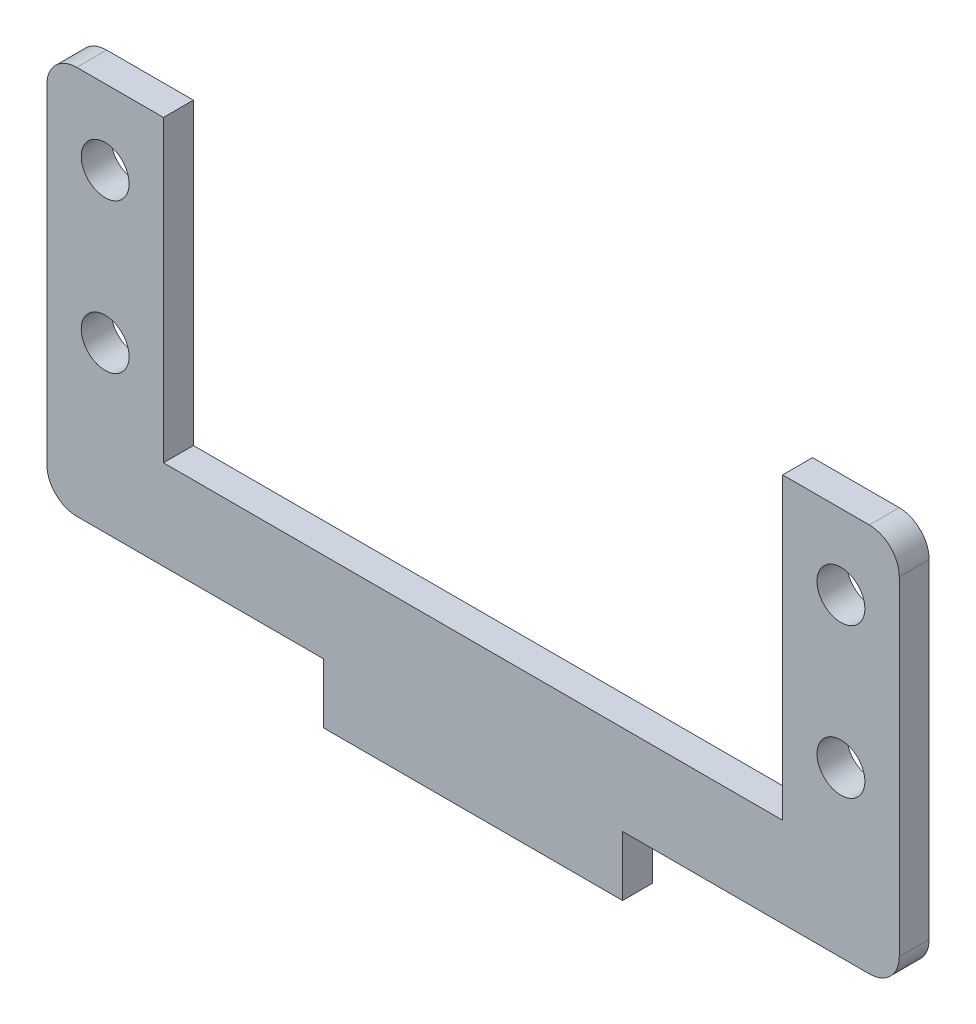
ISO-10303-21;
HEADER;
FILE_DESCRIPTION(('STEP AP214'),'2;1');
FILE_NAME('part.step','',(''),(''),'','','');
FILE_SCHEMA(('AUTOMOTIVE_DESIGN { 1 0 10303 214 1 1 1 1 }'));
ENDSEC;
DATA;
#1=APPLICATION_CONTEXT('core data for automotive mechanical design processes');
#2=APPLICATION_PROTOCOL_DEFINITION('international standard','automotive_design',2000,#1);
#3=PRODUCT_CONTEXT('',#1,'mechanical');
#4=PRODUCT('Part','Part','',(#3));
#5=PRODUCT_RELATED_PRODUCT_CATEGORY('part','',(#4));
#6=PRODUCT_DEFINITION_FORMATION('','',#4);
#7=PRODUCT_DEFINITION_CONTEXT('part definition',#1,'design');
#8=PRODUCT_DEFINITION('design','',#6,#7);
#9=PRODUCT_DEFINITION_SHAPE('','',#8);
#10=(LENGTH_UNIT() NAMED_UNIT(*) SI_UNIT(.MILLI.,.METRE.));
#11=(NAMED_UNIT(*) PLANE_ANGLE_UNIT() SI_UNIT($,.RADIAN.));
#12=(NAMED_UNIT(*) SI_UNIT($,.STERADIAN.) SOLID_ANGLE_UNIT());
#13=UNCERTAINTY_MEASURE_WITH_UNIT(LENGTH_MEASURE(1.E-05),#10,'distance_accuracy_value','');
#14=(GEOMETRIC_REPRESENTATION_CONTEXT(3) GLOBAL_UNCERTAINTY_ASSIGNED_CONTEXT((#13)) GLOBAL_UNIT_ASSIGNED_CONTEXT((#10,
#11,#12)) REPRESENTATION_CONTEXT('',''));
#15=CARTESIAN_POINT('',(0.,0.,0.));
#16=DIRECTION('',(0.,0.,1.));
#17=DIRECTION('',(1.,0.,0.));
#18=AXIS2_PLACEMENT_3D('',#15,#16,#17);
#19=CARTESIAN_POINT('',(0.,0.,2.));
#20=DIRECTION('',(0.,0.,1.));
#21=DIRECTION('',(1.,0.,0.));
#22=AXIS2_PLACEMENT_3D('',#19,#20,#21);
#23=PLANE('',#22);
#24=CARTESIAN_POINT('',(24.6,15.,2.));
#25=DIRECTION('',(0.,0.,1.));
#26=DIRECTION('',(1.,0.,0.));
#27=AXIS2_PLACEMENT_3D('',#24,#25,#26);
#28=CIRCLE('',#27,1.6);
#29=CARTESIAN_POINT('',(26.2,15.,2.));
#30=VERTEX_POINT('',#29);
#31=EDGE_CURVE('E296',#30,#30,#28,.T.);
#32=ORIENTED_EDGE('',*,*,#31,.F.);
#33=EDGE_LOOP('',(#32));
#34=FACE_BOUND('',#33,.T.);
#35=CARTESIAN_POINT('',(-24.6,25.,2.));
#36=DIRECTION('',(0.,0.,1.));
#37=DIRECTION('',(1.,0.,0.));
#38=AXIS2_PLACEMENT_3D('',#35,#36,#37);
#39=CIRCLE('',#38,1.6);
#40=CARTESIAN_POINT('',(-23.,25.,2.));
#41=VERTEX_POINT('',#40);
#42=EDGE_CURVE('E271',#41,#41,#39,.T.);
#43=ORIENTED_EDGE('',*,*,#42,.F.);
#44=EDGE_LOOP('',(#43));
#45=FACE_BOUND('',#44,.T.);
#46=DIRECTION('',(-1.,0.,0.));
#47=VECTOR('',#46,1.);
#48=CARTESIAN_POINT('',(-28.5,30.,2.));
#49=LINE('',#48,#47);
#50=CARTESIAN_POINT('',(-20.7,30.,2.));
#51=VERTEX_POINT('',#50);
#52=CARTESIAN_POINT('',(-26.5,30.,2.));
#53=VERTEX_POINT('',#52);
#54=EDGE_CURVE('E275',#51,#53,#49,.T.);
#55=ORIENTED_EDGE('',*,*,#54,.T.);
#56=CARTESIAN_POINT('',(-26.5,28.,2.));
#57=DIRECTION('',(0.,0.,1.));
#58=DIRECTION('',(1.,0.,0.));
#59=AXIS2_PLACEMENT_3D('',#56,#57,#58);
#60=CIRCLE('',#59,2.);
#61=CARTESIAN_POINT('',(-28.5,28.,2.));
#62=VERTEX_POINT('',#61);
#63=EDGE_CURVE('E194',#53,#62,#60,.T.);
#64=ORIENTED_EDGE('',*,*,#63,.T.);
#65=DIRECTION('',(0.,-1.,0.));
#66=VECTOR('',#65,1.);
#67=CARTESIAN_POINT('',(-28.5,3.99999999999999,2.));
#68=LINE('',#67,#66);
#69=CARTESIAN_POINT('',(-28.5,5.99999999999999,2.));
#70=VERTEX_POINT('',#69);
#71=EDGE_CURVE('E273',#62,#70,#68,.T.);
#72=ORIENTED_EDGE('',*,*,#71,.T.);
#73=CARTESIAN_POINT('',(-26.5,5.99999999999999,2.));
#74=DIRECTION('',(0.,0.,1.));
#75=DIRECTION('',(1.,0.,0.));
#76=AXIS2_PLACEMENT_3D('',#73,#74,#75);
#77=CIRCLE('',#76,2.);
#78=CARTESIAN_POINT('',(-26.5,3.99999999999999,2.));
#79=VERTEX_POINT('',#78);
#80=EDGE_CURVE('E47',#70,#79,#77,.T.);
#81=ORIENTED_EDGE('',*,*,#80,.T.);
#82=DIRECTION('',(1.,0.,0.));
#83=VECTOR('',#82,1.);
#84=CARTESIAN_POINT('',(-10.,4.,2.));
#85=LINE('',#84,#83);
#86=CARTESIAN_POINT('',(-10.,4.,2.));
#87=VERTEX_POINT('',#86);
#88=EDGE_CURVE('E161',#79,#87,#85,.T.);
#89=ORIENTED_EDGE('',*,*,#88,.T.);
#90=DIRECTION('',(0.,-1.,0.));
#91=VECTOR('',#90,1.);
#92=CARTESIAN_POINT('',(-10.,0.,2.));
#93=LINE('',#92,#91);
#94=CARTESIAN_POINT('',(-10.,0.,2.));
#95=VERTEX_POINT('',#94);
#96=EDGE_CURVE('E156',#87,#95,#93,.T.);
#97=ORIENTED_EDGE('',*,*,#96,.T.);
#98=DIRECTION('',(1.,0.,0.));
#99=VECTOR('',#98,1.);
#100=CARTESIAN_POINT('',(-10.,0.,2.));
#101=LINE('',#100,#99);
#102=CARTESIAN_POINT('',(10.,0.,2.));
#103=VERTEX_POINT('',#102);
#104=EDGE_CURVE('E146',#95,#103,#101,.T.);
#105=ORIENTED_EDGE('',*,*,#104,.T.);
#106=DIRECTION('',(0.,1.,0.));
#107=VECTOR('',#106,1.);
#108=CARTESIAN_POINT('',(10.,0.,2.));
#109=LINE('',#108,#107);
#110=CARTESIAN_POINT('',(10.,4.,2.));
#111=VERTEX_POINT('',#110);
#112=EDGE_CURVE('E155',#103,#111,#109,.T.);
#113=ORIENTED_EDGE('',*,*,#112,.T.);
#114=DIRECTION('',(1.,0.,0.));
#115=VECTOR('',#114,1.);
#116=CARTESIAN_POINT('',(10.,4.,2.));
#117=LINE('',#116,#115);
#118=CARTESIAN_POINT('',(26.5,3.99999999999999,2.));
#119=VERTEX_POINT('',#118);
#120=EDGE_CURVE('E210',#111,#119,#117,.T.);
#121=ORIENTED_EDGE('',*,*,#120,.T.);
#122=CARTESIAN_POINT('',(26.5,5.99999999999999,2.));
#123=DIRECTION('',(0.,0.,1.));
#124=DIRECTION('',(1.,0.,0.));
#125=AXIS2_PLACEMENT_3D('',#122,#123,#124);
#126=CIRCLE('',#125,2.);
#127=CARTESIAN_POINT('',(28.5,5.99999999999999,2.));
#128=VERTEX_POINT('',#127);
#129=EDGE_CURVE('E191',#119,#128,#126,.T.);
#130=ORIENTED_EDGE('',*,*,#129,.T.);
#131=DIRECTION('',(0.,1.,0.));
#132=VECTOR('',#131,1.);
#133=CARTESIAN_POINT('',(28.5,3.99999999999999,2.));
#134=LINE('',#133,#132);
#135=CARTESIAN_POINT('',(28.5,28.,2.));
#136=VERTEX_POINT('',#135);
#137=EDGE_CURVE('E217',#128,#136,#134,.T.);
#138=ORIENTED_EDGE('',*,*,#137,.T.);
#139=CARTESIAN_POINT('',(26.5,28.,2.));
#140=DIRECTION('',(0.,0.,1.));
#141=DIRECTION('',(1.,0.,0.));
#142=AXIS2_PLACEMENT_3D('',#139,#140,#141);
#143=CIRCLE('',#142,2.);
#144=CARTESIAN_POINT('',(26.5,30.,2.));
#145=VERTEX_POINT('',#144);
#146=EDGE_CURVE('E54',#136,#145,#143,.T.);
#147=ORIENTED_EDGE('',*,*,#146,.T.);
#148=DIRECTION('',(-1.,0.,0.));
#149=VECTOR('',#148,1.);
#150=CARTESIAN_POINT('',(28.5,30.,2.));
#151=LINE('',#150,#149);
#152=CARTESIAN_POINT('',(20.7,30.,2.));
#153=VERTEX_POINT('',#152);
#154=EDGE_CURVE('E283',#145,#153,#151,.T.);
#155=ORIENTED_EDGE('',*,*,#154,.T.);
#156=DIRECTION('',(0.,-1.,0.));
#157=VECTOR('',#156,1.);
#158=CARTESIAN_POINT('',(20.7,30.,2.));
#159=LINE('',#158,#157);
#160=CARTESIAN_POINT('',(20.7,10.,2.));
#161=VERTEX_POINT('',#160);
#162=EDGE_CURVE('E281',#153,#161,#159,.T.);
#163=ORIENTED_EDGE('',*,*,#162,.T.);
#164=DIRECTION('',(-1.,0.,0.));
#165=VECTOR('',#164,1.);
#166=CARTESIAN_POINT('',(-20.7,10.,2.));
#167=LINE('',#166,#165);
#168=CARTESIAN_POINT('',(-20.7,10.,2.));
#169=VERTEX_POINT('',#168);
#170=EDGE_CURVE('E279',#161,#169,#167,.T.);
#171=ORIENTED_EDGE('',*,*,#170,.T.);
#172=DIRECTION('',(0.,1.,0.));
#173=VECTOR('',#172,1.);
#174=CARTESIAN_POINT('',(-20.7,30.,2.));
#175=LINE('',#174,#173);
#176=EDGE_CURVE('E277',#169,#51,#175,.T.);
#177=ORIENTED_EDGE('',*,*,#176,.T.);
#178=EDGE_LOOP('',(#55,#64,#72,#81,#89,#97,#105,#113,#121,#130,#138,#147,#155,#163,#171,#177));
#179=FACE_BOUND('',#178,.T.);
#180=CARTESIAN_POINT('',(-24.6,15.,2.));
#181=DIRECTION('',(0.,0.,1.));
#182=DIRECTION('',(-1.,0.,0.));
#183=AXIS2_PLACEMENT_3D('',#180,#181,#182);
#184=CIRCLE('',#183,1.6);
#185=CARTESIAN_POINT('',(-26.2,15.,2.));
#186=VERTEX_POINT('',#185);
#187=EDGE_CURVE('E290',#186,#186,#184,.T.);
#188=ORIENTED_EDGE('',*,*,#187,.F.);
#189=EDGE_LOOP('',(#188));
#190=FACE_BOUND('',#189,.T.);
#191=CARTESIAN_POINT('',(24.6,25.,2.));
#192=DIRECTION('',(0.,0.,1.));
#193=DIRECTION('',(-1.,0.,0.));
#194=AXIS2_PLACEMENT_3D('',#191,#192,#193);
#195=CIRCLE('',#194,1.6);
#196=CARTESIAN_POINT('',(23.,25.,2.));
#197=VERTEX_POINT('',#196);
#198=EDGE_CURVE('E302',#197,#197,#195,.T.);
#199=ORIENTED_EDGE('',*,*,#198,.F.);
#200=EDGE_LOOP('',(#199));
#201=FACE_BOUND('',#200,.T.);
#202=ADVANCED_FACE('F32',(#34,#45,#179,#190,#201),#23,.T.);
#203=CARTESIAN_POINT('',(0.,0.,0.));
#204=DIRECTION('',(0.,0.,1.));
#205=DIRECTION('',(1.,0.,0.));
#206=AXIS2_PLACEMENT_3D('',#203,#204,#205);
#207=PLANE('',#206);
#208=CARTESIAN_POINT('',(24.6,15.,0.));
#209=DIRECTION('',(0.,0.,1.));
#210=DIRECTION('',(1.,0.,0.));
#211=AXIS2_PLACEMENT_3D('',#208,#209,#210);
#212=CIRCLE('',#211,1.6);
#213=CARTESIAN_POINT('',(26.2,15.,0.));
#214=VERTEX_POINT('',#213);
#215=EDGE_CURVE('E299',#214,#214,#212,.T.);
#216=ORIENTED_EDGE('',*,*,#215,.T.);
#217=EDGE_LOOP('',(#216));
#218=FACE_BOUND('',#217,.T.);
#219=CARTESIAN_POINT('',(-24.6,25.,0.));
#220=DIRECTION('',(0.,0.,1.));
#221=DIRECTION('',(1.,0.,0.));
#222=AXIS2_PLACEMENT_3D('',#219,#220,#221);
#223=CIRCLE('',#222,1.6);
#224=CARTESIAN_POINT('',(-23.,25.,0.));
#225=VERTEX_POINT('',#224);
#226=EDGE_CURVE('E287',#225,#225,#223,.T.);
#227=ORIENTED_EDGE('',*,*,#226,.T.);
#228=EDGE_LOOP('',(#227));
#229=FACE_BOUND('',#228,.T.);
#230=DIRECTION('',(0.,-1.,0.));
#231=VECTOR('',#230,1.);
#232=CARTESIAN_POINT('',(-28.5,3.99999999999999,0.));
#233=LINE('',#232,#231);
#234=CARTESIAN_POINT('',(-28.5,28.,0.));
#235=VERTEX_POINT('',#234);
#236=CARTESIAN_POINT('',(-28.5,5.99999999999999,0.));
#237=VERTEX_POINT('',#236);
#238=EDGE_CURVE('E248',#235,#237,#233,.T.);
#239=ORIENTED_EDGE('',*,*,#238,.F.);
#240=CARTESIAN_POINT('',(-26.5,28.,0.));
#241=DIRECTION('',(0.,0.,1.));
#242=DIRECTION('',(1.,0.,0.));
#243=AXIS2_PLACEMENT_3D('',#240,#241,#242);
#244=CIRCLE('',#243,2.);
#245=CARTESIAN_POINT('',(-26.5,30.,0.));
#246=VERTEX_POINT('',#245);
#247=EDGE_CURVE('E186',#235,#246,#244,.F.);
#248=ORIENTED_EDGE('',*,*,#247,.T.);
#249=DIRECTION('',(-1.,0.,0.));
#250=VECTOR('',#249,1.);
#251=CARTESIAN_POINT('',(-28.5,30.,0.));
#252=LINE('',#251,#250);
#253=CARTESIAN_POINT('',(-20.7,30.,0.));
#254=VERTEX_POINT('',#253);
#255=EDGE_CURVE('E245',#254,#246,#252,.T.);
#256=ORIENTED_EDGE('',*,*,#255,.F.);
#257=DIRECTION('',(0.,1.,0.));
#258=VECTOR('',#257,1.);
#259=CARTESIAN_POINT('',(-20.7,30.,0.));
#260=LINE('',#259,#258);
#261=CARTESIAN_POINT('',(-20.7,10.,0.));
#262=VERTEX_POINT('',#261);
#263=EDGE_CURVE('E243',#262,#254,#260,.T.);
#264=ORIENTED_EDGE('',*,*,#263,.F.);
#265=DIRECTION('',(-1.,0.,0.));
#266=VECTOR('',#265,1.);
#267=CARTESIAN_POINT('',(-20.7,10.,0.));
#268=LINE('',#267,#266);
#269=CARTESIAN_POINT('',(20.7,10.,0.));
#270=VERTEX_POINT('',#269);
#271=EDGE_CURVE('E241',#270,#262,#268,.T.);
#272=ORIENTED_EDGE('',*,*,#271,.F.);
#273=DIRECTION('',(0.,-1.,0.));
#274=VECTOR('',#273,1.);
#275=CARTESIAN_POINT('',(20.7,30.,0.));
#276=LINE('',#275,#274);
#277=CARTESIAN_POINT('',(20.7,30.,0.));
#278=VERTEX_POINT('',#277);
#279=EDGE_CURVE('E234',#278,#270,#276,.T.);
#280=ORIENTED_EDGE('',*,*,#279,.F.);
#281=DIRECTION('',(-1.,0.,0.));
#282=VECTOR('',#281,1.);
#283=CARTESIAN_POINT('',(28.5,30.,0.));
#284=LINE('',#283,#282);
#285=CARTESIAN_POINT('',(26.5,30.,0.));
#286=VERTEX_POINT('',#285);
#287=EDGE_CURVE('E232',#286,#278,#284,.T.);
#288=ORIENTED_EDGE('',*,*,#287,.F.);
#289=CARTESIAN_POINT('',(26.5,28.,0.));
#290=DIRECTION('',(0.,0.,1.));
#291=DIRECTION('',(1.,0.,0.));
#292=AXIS2_PLACEMENT_3D('',#289,#290,#291);
#293=CIRCLE('',#292,2.);
#294=CARTESIAN_POINT('',(28.5,28.,0.));
#295=VERTEX_POINT('',#294);
#296=EDGE_CURVE('E184',#286,#295,#293,.F.);
#297=ORIENTED_EDGE('',*,*,#296,.T.);
#298=DIRECTION('',(0.,1.,0.));
#299=VECTOR('',#298,1.);
#300=CARTESIAN_POINT('',(28.5,3.99999999999999,0.));
#301=LINE('',#300,#299);
#302=CARTESIAN_POINT('',(28.5,5.99999999999999,0.));
#303=VERTEX_POINT('',#302);
#304=EDGE_CURVE('E225',#303,#295,#301,.T.);
#305=ORIENTED_EDGE('',*,*,#304,.F.);
#306=CARTESIAN_POINT('',(26.5,5.99999999999999,0.));
#307=DIRECTION('',(0.,0.,1.));
#308=DIRECTION('',(1.,0.,0.));
#309=AXIS2_PLACEMENT_3D('',#306,#307,#308);
#310=CIRCLE('',#309,2.);
#311=CARTESIAN_POINT('',(26.5,3.99999999999999,0.));
#312=VERTEX_POINT('',#311);
#313=EDGE_CURVE('E182',#303,#312,#310,.F.);
#314=ORIENTED_EDGE('',*,*,#313,.T.);
#315=DIRECTION('',(1.,0.,0.));
#316=VECTOR('',#315,1.);
#317=CARTESIAN_POINT('',(10.,4.,0.));
#318=LINE('',#317,#316);
#319=CARTESIAN_POINT('',(10.,4.,0.));
#320=VERTEX_POINT('',#319);
#321=EDGE_CURVE('E212',#320,#312,#318,.T.);
#322=ORIENTED_EDGE('',*,*,#321,.F.);
#323=DIRECTION('',(0.,1.,0.));
#324=VECTOR('',#323,1.);
#325=CARTESIAN_POINT('',(10.,0.,0.));
#326=LINE('',#325,#324);
#327=CARTESIAN_POINT('',(10.,0.,0.));
#328=VERTEX_POINT('',#327);
#329=EDGE_CURVE('E236',#328,#320,#326,.T.);
#330=ORIENTED_EDGE('',*,*,#329,.F.);
#331=DIRECTION('',(1.,0.,0.));
#332=VECTOR('',#331,1.);
#333=CARTESIAN_POINT('',(-10.,0.,0.));
#334=LINE('',#333,#332);
#335=CARTESIAN_POINT('',(-10.,0.,0.));
#336=VERTEX_POINT('',#335);
#337=EDGE_CURVE('E267',#336,#328,#334,.T.);
#338=ORIENTED_EDGE('',*,*,#337,.F.);
#339=DIRECTION('',(0.,-1.,0.));
#340=VECTOR('',#339,1.);
#341=CARTESIAN_POINT('',(-10.,0.,0.));
#342=LINE('',#341,#340);
#343=CARTESIAN_POINT('',(-10.,4.,0.));
#344=VERTEX_POINT('',#343);
#345=EDGE_CURVE('E169',#344,#336,#342,.T.);
#346=ORIENTED_EDGE('',*,*,#345,.F.);
#347=DIRECTION('',(1.,0.,0.));
#348=VECTOR('',#347,1.);
#349=CARTESIAN_POINT('',(-10.,4.,0.));
#350=LINE('',#349,#348);
#351=CARTESIAN_POINT('',(-26.5,3.99999999999999,0.));
#352=VERTEX_POINT('',#351);
#353=EDGE_CURVE('E165',#352,#344,#350,.T.);
#354=ORIENTED_EDGE('',*,*,#353,.F.);
#355=CARTESIAN_POINT('',(-26.5,5.99999999999999,0.));
#356=DIRECTION('',(0.,0.,1.));
#357=DIRECTION('',(1.,0.,0.));
#358=AXIS2_PLACEMENT_3D('',#355,#356,#357);
#359=CIRCLE('',#358,2.);
#360=EDGE_CURVE('E180',#352,#237,#359,.F.);
#361=ORIENTED_EDGE('',*,*,#360,.T.);
#362=EDGE_LOOP('',(#239,#248,#256,#264,#272,#280,#288,#297,#305,#314,#322,#330,#338,#346,#354,#361));
#363=FACE_BOUND('',#362,.T.);
#364=CARTESIAN_POINT('',(-24.6,15.,0.));
#365=DIRECTION('',(0.,0.,1.));
#366=DIRECTION('',(-1.,0.,0.));
#367=AXIS2_PLACEMENT_3D('',#364,#365,#366);
#368=CIRCLE('',#367,1.6);
#369=CARTESIAN_POINT('',(-26.2,15.,0.));
#370=VERTEX_POINT('',#369);
#371=EDGE_CURVE('E293',#370,#370,#368,.T.);
#372=ORIENTED_EDGE('',*,*,#371,.T.);
#373=EDGE_LOOP('',(#372));
#374=FACE_BOUND('',#373,.T.);
#375=CARTESIAN_POINT('',(24.6,25.,0.));
#376=DIRECTION('',(0.,0.,1.));
#377=DIRECTION('',(-1.,0.,0.));
#378=AXIS2_PLACEMENT_3D('',#375,#376,#377);
#379=CIRCLE('',#378,1.6);
#380=CARTESIAN_POINT('',(23.,25.,0.));
#381=VERTEX_POINT('',#380);
#382=EDGE_CURVE('E305',#381,#381,#379,.T.);
#383=ORIENTED_EDGE('',*,*,#382,.T.);
#384=EDGE_LOOP('',(#383));
#385=FACE_BOUND('',#384,.T.);
#386=ADVANCED_FACE('F229',(#218,#229,#363,#374,#385),#207,.F.);
#387=CARTESIAN_POINT('',(-10.,0.,2.));
#388=DIRECTION('',(1.,0.,0.));
#389=DIRECTION('',(0.,0.,-1.));
#390=AXIS2_PLACEMENT_3D('',#387,#388,#389);
#391=PLANE('',#390);
#392=ORIENTED_EDGE('',*,*,#345,.T.);
#393=DIRECTION('',(0.,0.,-1.));
#394=VECTOR('',#393,1.);
#395=CARTESIAN_POINT('',(-10.,0.,2.));
#396=LINE('',#395,#394);
#397=EDGE_CURVE('E150',#95,#336,#396,.T.);
#398=ORIENTED_EDGE('',*,*,#397,.F.);
#399=ORIENTED_EDGE('',*,*,#96,.F.);
#400=DIRECTION('',(0.,0.,-1.));
#401=VECTOR('',#400,1.);
#402=CARTESIAN_POINT('',(-10.,4.,2.));
#403=LINE('',#402,#401);
#404=EDGE_CURVE('E252',#87,#344,#403,.T.);
#405=ORIENTED_EDGE('',*,*,#404,.T.);
#406=EDGE_LOOP('',(#392,#398,#399,#405));
#407=FACE_BOUND('',#406,.T.);
#408=ADVANCED_FACE('F167',(#407),#391,.F.);
#409=CARTESIAN_POINT('',(-10.,0.,2.));
#410=DIRECTION('',(0.,1.,0.));
#411=DIRECTION('',(0.,0.,1.));
#412=AXIS2_PLACEMENT_3D('',#409,#410,#411);
#413=PLANE('',#412);
#414=ORIENTED_EDGE('',*,*,#337,.T.);
#415=DIRECTION('',(0.,0.,-1.));
#416=VECTOR('',#415,1.);
#417=CARTESIAN_POINT('',(10.,0.,2.));
#418=LINE('',#417,#416);
#419=EDGE_CURVE('E153',#103,#328,#418,.T.);
#420=ORIENTED_EDGE('',*,*,#419,.F.);
#421=ORIENTED_EDGE('',*,*,#104,.F.);
#422=ORIENTED_EDGE('',*,*,#397,.T.);
#423=EDGE_LOOP('',(#414,#420,#421,#422));
#424=FACE_BOUND('',#423,.T.);
#425=ADVANCED_FACE('F148',(#424),#413,.F.);
#426=CARTESIAN_POINT('',(10.,0.,2.));
#427=DIRECTION('',(-1.,0.,0.));
#428=DIRECTION('',(0.,0.,1.));
#429=AXIS2_PLACEMENT_3D('',#426,#427,#428);
#430=PLANE('',#429);
#431=ORIENTED_EDGE('',*,*,#329,.T.);
#432=DIRECTION('',(0.,0.,-1.));
#433=VECTOR('',#432,1.);
#434=CARTESIAN_POINT('',(10.,4.,2.));
#435=LINE('',#434,#433);
#436=EDGE_CURVE('E174',#111,#320,#435,.T.);
#437=ORIENTED_EDGE('',*,*,#436,.F.);
#438=ORIENTED_EDGE('',*,*,#112,.F.);
#439=ORIENTED_EDGE('',*,*,#419,.T.);
#440=EDGE_LOOP('',(#431,#437,#438,#439));
#441=FACE_BOUND('',#440,.T.);
#442=ADVANCED_FACE('F360',(#441),#430,.F.);
#443=CARTESIAN_POINT('',(10.,4.,2.));
#444=DIRECTION('',(0.,1.,0.));
#445=DIRECTION('',(-1.,0.,0.));
#446=AXIS2_PLACEMENT_3D('',#443,#444,#445);
#447=PLANE('',#446);
#448=ORIENTED_EDGE('',*,*,#321,.T.);
#449=DIRECTION('',(0.,0.,-1.));
#450=VECTOR('',#449,1.);
#451=CARTESIAN_POINT('',(26.5,3.99999999999999,2.));
#452=LINE('',#451,#450);
#453=EDGE_CURVE('E40',#312,#119,#452,.F.);
#454=ORIENTED_EDGE('',*,*,#453,.T.);
#455=ORIENTED_EDGE('',*,*,#120,.F.);
#456=ORIENTED_EDGE('',*,*,#436,.T.);
#457=EDGE_LOOP('',(#448,#454,#455,#456));
#458=FACE_BOUND('',#457,.T.);
#459=ADVANCED_FACE('F208',(#458),#447,.F.);
#460=CARTESIAN_POINT('',(28.5,3.99999999999999,2.));
#461=DIRECTION('',(-1.,0.,0.));
#462=DIRECTION('',(0.,0.,1.));
#463=AXIS2_PLACEMENT_3D('',#460,#461,#462);
#464=PLANE('',#463);
#465=ORIENTED_EDGE('',*,*,#304,.T.);
#466=DIRECTION('',(0.,0.,-1.));
#467=VECTOR('',#466,1.);
#468=CARTESIAN_POINT('',(28.5,28.,2.));
#469=LINE('',#468,#467);
#470=EDGE_CURVE('E202',#295,#136,#469,.F.);
#471=ORIENTED_EDGE('',*,*,#470,.T.);
#472=ORIENTED_EDGE('',*,*,#137,.F.);
#473=DIRECTION('',(0.,0.,-1.));
#474=VECTOR('',#473,1.);
#475=CARTESIAN_POINT('',(28.5,5.99999999999999,2.));
#476=LINE('',#475,#474);
#477=EDGE_CURVE('E199',#128,#303,#476,.T.);
#478=ORIENTED_EDGE('',*,*,#477,.T.);
#479=EDGE_LOOP('',(#465,#471,#472,#478));
#480=FACE_BOUND('',#479,.T.);
#481=ADVANCED_FACE('F224',(#480),#464,.F.);
#482=CARTESIAN_POINT('',(28.5,30.,2.));
#483=DIRECTION('',(0.,-1.,0.));
#484=DIRECTION('',(1.,0.,0.));
#485=AXIS2_PLACEMENT_3D('',#482,#483,#484);
#486=PLANE('',#485);
#487=ORIENTED_EDGE('',*,*,#154,.F.);
#488=DIRECTION('',(0.,0.,-1.));
#489=VECTOR('',#488,1.);
#490=CARTESIAN_POINT('',(26.5,30.,2.));
#491=LINE('',#490,#489);
#492=EDGE_CURVE('E196',#145,#286,#491,.T.);
#493=ORIENTED_EDGE('',*,*,#492,.T.);
#494=ORIENTED_EDGE('',*,*,#287,.T.);
#495=DIRECTION('',(0.,0.,-1.));
#496=VECTOR('',#495,1.);
#497=CARTESIAN_POINT('',(20.7,30.,2.));
#498=LINE('',#497,#496);
#499=EDGE_CURVE('E263',#153,#278,#498,.T.);
#500=ORIENTED_EDGE('',*,*,#499,.F.);
#501=EDGE_LOOP('',(#487,#493,#494,#500));
#502=FACE_BOUND('',#501,.T.);
#503=ADVANCED_FACE('F351',(#502),#486,.F.);
#504=CARTESIAN_POINT('',(20.7,30.,2.));
#505=DIRECTION('',(1.,0.,0.));
#506=DIRECTION('',(0.,1.,0.));
#507=AXIS2_PLACEMENT_3D('',#504,#505,#506);
#508=PLANE('',#507);
#509=ORIENTED_EDGE('',*,*,#279,.T.);
#510=DIRECTION('',(0.,0.,-1.));
#511=VECTOR('',#510,1.);
#512=CARTESIAN_POINT('',(20.7,10.,2.));
#513=LINE('',#512,#511);
#514=EDGE_CURVE('E260',#161,#270,#513,.T.);
#515=ORIENTED_EDGE('',*,*,#514,.F.);
#516=ORIENTED_EDGE('',*,*,#162,.F.);
#517=ORIENTED_EDGE('',*,*,#499,.T.);
#518=EDGE_LOOP('',(#509,#515,#516,#517));
#519=FACE_BOUND('',#518,.T.);
#520=ADVANCED_FACE('F347',(#519),#508,.F.);
#521=CARTESIAN_POINT('',(-20.7,10.,2.));
#522=DIRECTION('',(0.,-1.,0.));
#523=DIRECTION('',(0.,0.,-1.));
#524=AXIS2_PLACEMENT_3D('',#521,#522,#523);
#525=PLANE('',#524);
#526=ORIENTED_EDGE('',*,*,#271,.T.);
#527=DIRECTION('',(0.,0.,-1.));
#528=VECTOR('',#527,1.);
#529=CARTESIAN_POINT('',(-20.7,10.,2.));
#530=LINE('',#529,#528);
#531=EDGE_CURVE('E257',#169,#262,#530,.T.);
#532=ORIENTED_EDGE('',*,*,#531,.F.);
#533=ORIENTED_EDGE('',*,*,#170,.F.);
#534=ORIENTED_EDGE('',*,*,#514,.T.);
#535=EDGE_LOOP('',(#526,#532,#533,#534));
#536=FACE_BOUND('',#535,.T.);
#537=ADVANCED_FACE('F343',(#536),#525,.F.);
#538=CARTESIAN_POINT('',(-20.7,30.,2.));
#539=DIRECTION('',(-1.,0.,0.));
#540=DIRECTION('',(0.,0.,1.));
#541=AXIS2_PLACEMENT_3D('',#538,#539,#540);
#542=PLANE('',#541);
#543=ORIENTED_EDGE('',*,*,#263,.T.);
#544=DIRECTION('',(0.,0.,-1.));
#545=VECTOR('',#544,1.);
#546=CARTESIAN_POINT('',(-20.7,30.,2.));
#547=LINE('',#546,#545);
#548=EDGE_CURVE('E254',#51,#254,#547,.T.);
#549=ORIENTED_EDGE('',*,*,#548,.F.);
#550=ORIENTED_EDGE('',*,*,#176,.F.);
#551=ORIENTED_EDGE('',*,*,#531,.T.);
#552=EDGE_LOOP('',(#543,#549,#550,#551));
#553=FACE_BOUND('',#552,.T.);
#554=ADVANCED_FACE('F339',(#553),#542,.F.);
#555=CARTESIAN_POINT('',(-28.5,30.,2.));
#556=DIRECTION('',(0.,-1.,0.));
#557=DIRECTION('',(0.,0.,-1.));
#558=AXIS2_PLACEMENT_3D('',#555,#556,#557);
#559=PLANE('',#558);
#560=ORIENTED_EDGE('',*,*,#255,.T.);
#561=DIRECTION('',(0.,0.,-1.));
#562=VECTOR('',#561,1.);
#563=CARTESIAN_POINT('',(-26.5,30.,2.));
#564=LINE('',#563,#562);
#565=EDGE_CURVE('E188',#246,#53,#564,.F.);
#566=ORIENTED_EDGE('',*,*,#565,.T.);
#567=ORIENTED_EDGE('',*,*,#54,.F.);
#568=ORIENTED_EDGE('',*,*,#548,.T.);
#569=EDGE_LOOP('',(#560,#566,#567,#568));
#570=FACE_BOUND('',#569,.T.);
#571=ADVANCED_FACE('F335',(#570),#559,.F.);
#572=CARTESIAN_POINT('',(-28.5,3.99999999999999,2.));
#573=DIRECTION('',(1.,0.,0.));
#574=DIRECTION('',(0.,0.,-1.));
#575=AXIS2_PLACEMENT_3D('',#572,#573,#574);
#576=PLANE('',#575);
#577=ORIENTED_EDGE('',*,*,#71,.F.);
#578=DIRECTION('',(0.,0.,-1.));
#579=VECTOR('',#578,1.);
#580=CARTESIAN_POINT('',(-28.5,28.,2.));
#581=LINE('',#580,#579);
#582=EDGE_CURVE('E172',#62,#235,#581,.T.);
#583=ORIENTED_EDGE('',*,*,#582,.T.);
#584=ORIENTED_EDGE('',*,*,#238,.T.);
#585=DIRECTION('',(0.,0.,-1.));
#586=VECTOR('',#585,1.);
#587=CARTESIAN_POINT('',(-28.5,5.99999999999999,2.));
#588=LINE('',#587,#586);
#589=EDGE_CURVE('E170',#237,#70,#588,.F.);
#590=ORIENTED_EDGE('',*,*,#589,.T.);
#591=EDGE_LOOP('',(#577,#583,#584,#590));
#592=FACE_BOUND('',#591,.T.);
#593=ADVANCED_FACE('F331',(#592),#576,.F.);
#594=CARTESIAN_POINT('',(-10.,4.,2.));
#595=DIRECTION('',(0.,1.,0.));
#596=DIRECTION('',(-1.,0.,0.));
#597=AXIS2_PLACEMENT_3D('',#594,#595,#596);
#598=PLANE('',#597);
#599=ORIENTED_EDGE('',*,*,#88,.F.);
#600=DIRECTION('',(0.,0.,-1.));
#601=VECTOR('',#600,1.);
#602=CARTESIAN_POINT('',(-26.5,3.99999999999999,2.));
#603=LINE('',#602,#601);
#604=EDGE_CURVE('E11',#79,#352,#603,.T.);
#605=ORIENTED_EDGE('',*,*,#604,.T.);
#606=ORIENTED_EDGE('',*,*,#353,.T.);
#607=ORIENTED_EDGE('',*,*,#404,.F.);
#608=EDGE_LOOP('',(#599,#605,#606,#607));
#609=FACE_BOUND('',#608,.T.);
#610=ADVANCED_FACE('F328',(#609),#598,.F.);
#611=CARTESIAN_POINT('',(-24.6,25.,2.));
#612=DIRECTION('',(0.,0.,-1.));
#613=DIRECTION('',(-1.,0.,0.));
#614=AXIS2_PLACEMENT_3D('',#611,#612,#613);
#615=CYLINDRICAL_SURFACE('',#614,1.6);
#616=ORIENTED_EDGE('',*,*,#42,.T.);
#617=EDGE_LOOP('',(#616));
#618=FACE_BOUND('',#617,.T.);
#619=ORIENTED_EDGE('',*,*,#226,.F.);
#620=EDGE_LOOP('',(#619));
#621=FACE_BOUND('',#620,.T.);
#622=ADVANCED_FACE('F325',(#618,#621),#615,.F.);
#623=CARTESIAN_POINT('',(-24.6,15.,2.));
#624=DIRECTION('',(0.,0.,-1.));
#625=DIRECTION('',(-1.,0.,0.));
#626=AXIS2_PLACEMENT_3D('',#623,#624,#625);
#627=CYLINDRICAL_SURFACE('',#626,1.6);
#628=ORIENTED_EDGE('',*,*,#187,.T.);
#629=EDGE_LOOP('',(#628));
#630=FACE_BOUND('',#629,.T.);
#631=ORIENTED_EDGE('',*,*,#371,.F.);
#632=EDGE_LOOP('',(#631));
#633=FACE_BOUND('',#632,.T.);
#634=ADVANCED_FACE('F487',(#630,#633),#627,.F.);
#635=CARTESIAN_POINT('',(24.6,15.,2.));
#636=DIRECTION('',(0.,0.,-1.));
#637=DIRECTION('',(-1.,0.,0.));
#638=AXIS2_PLACEMENT_3D('',#635,#636,#637);
#639=CYLINDRICAL_SURFACE('',#638,1.6);
#640=ORIENTED_EDGE('',*,*,#31,.T.);
#641=EDGE_LOOP('',(#640));
#642=FACE_BOUND('',#641,.T.);
#643=ORIENTED_EDGE('',*,*,#215,.F.);
#644=EDGE_LOOP('',(#643));
#645=FACE_BOUND('',#644,.T.);
#646=ADVANCED_FACE('F478',(#642,#645),#639,.F.);
#647=CARTESIAN_POINT('',(24.6,25.,2.));
#648=DIRECTION('',(0.,0.,-1.));
#649=DIRECTION('',(-1.,0.,0.));
#650=AXIS2_PLACEMENT_3D('',#647,#648,#649);
#651=CYLINDRICAL_SURFACE('',#650,1.6);
#652=ORIENTED_EDGE('',*,*,#198,.T.);
#653=EDGE_LOOP('',(#652));
#654=FACE_BOUND('',#653,.T.);
#655=ORIENTED_EDGE('',*,*,#382,.F.);
#656=EDGE_LOOP('',(#655));
#657=FACE_BOUND('',#656,.T.);
#658=ADVANCED_FACE('F311',(#654,#657),#651,.F.);
#659=CARTESIAN_POINT('',(-26.5,28.,2.));
#660=DIRECTION('',(0.,0.,-1.));
#661=DIRECTION('',(-1.,0.,0.));
#662=AXIS2_PLACEMENT_3D('',#659,#660,#661);
#663=CYLINDRICAL_SURFACE('',#662,2.);
#664=ORIENTED_EDGE('',*,*,#63,.F.);
#665=ORIENTED_EDGE('',*,*,#565,.F.);
#666=ORIENTED_EDGE('',*,*,#247,.F.);
#667=ORIENTED_EDGE('',*,*,#582,.F.);
#668=EDGE_LOOP('',(#664,#665,#666,#667));
#669=FACE_BOUND('',#668,.T.);
#670=ADVANCED_FACE('F367',(#669),#663,.T.);
#671=CARTESIAN_POINT('',(26.5,28.,2.));
#672=DIRECTION('',(0.,0.,-1.));
#673=DIRECTION('',(-1.,0.,0.));
#674=AXIS2_PLACEMENT_3D('',#671,#672,#673);
#675=CYLINDRICAL_SURFACE('',#674,2.);
#676=ORIENTED_EDGE('',*,*,#146,.F.);
#677=ORIENTED_EDGE('',*,*,#470,.F.);
#678=ORIENTED_EDGE('',*,*,#296,.F.);
#679=ORIENTED_EDGE('',*,*,#492,.F.);
#680=EDGE_LOOP('',(#676,#677,#678,#679));
#681=FACE_BOUND('',#680,.T.);
#682=ADVANCED_FACE('F370',(#681),#675,.T.);
#683=CARTESIAN_POINT('',(26.5,5.99999999999999,2.));
#684=DIRECTION('',(0.,0.,-1.));
#685=DIRECTION('',(-1.,0.,0.));
#686=AXIS2_PLACEMENT_3D('',#683,#684,#685);
#687=CYLINDRICAL_SURFACE('',#686,2.);
#688=ORIENTED_EDGE('',*,*,#129,.F.);
#689=ORIENTED_EDGE('',*,*,#453,.F.);
#690=ORIENTED_EDGE('',*,*,#313,.F.);
#691=ORIENTED_EDGE('',*,*,#477,.F.);
#692=EDGE_LOOP('',(#688,#689,#690,#691));
#693=FACE_BOUND('',#692,.T.);
#694=ADVANCED_FACE('F220',(#693),#687,.T.);
#695=CARTESIAN_POINT('',(-26.5,5.99999999999999,2.));
#696=DIRECTION('',(0.,0.,-1.));
#697=DIRECTION('',(-1.,0.,0.));
#698=AXIS2_PLACEMENT_3D('',#695,#696,#697);
#699=CYLINDRICAL_SURFACE('',#698,2.);
#700=ORIENTED_EDGE('',*,*,#80,.F.);
#701=ORIENTED_EDGE('',*,*,#589,.F.);
#702=ORIENTED_EDGE('',*,*,#360,.F.);
#703=ORIENTED_EDGE('',*,*,#604,.F.);
#704=EDGE_LOOP('',(#700,#701,#702,#703));
#705=FACE_BOUND('',#704,.T.);
#706=ADVANCED_FACE('F34',(#705),#699,.T.);
#707=CLOSED_SHELL('',(#202,#386,#408,#425,#442,#459,#481,#503,#520,#537,#554,#571,#593,#610,
#622,#634,#646,#658,#670,#682,#694,#706));
#708=MANIFOLD_SOLID_BREP('B2',#707);
#709=ADVANCED_BREP_SHAPE_REPRESENTATION('',(#18,#708),#14);
#710=SHAPE_DEFINITION_REPRESENTATION(#9,#709);
ENDSEC;
END-ISO-10303-21;
